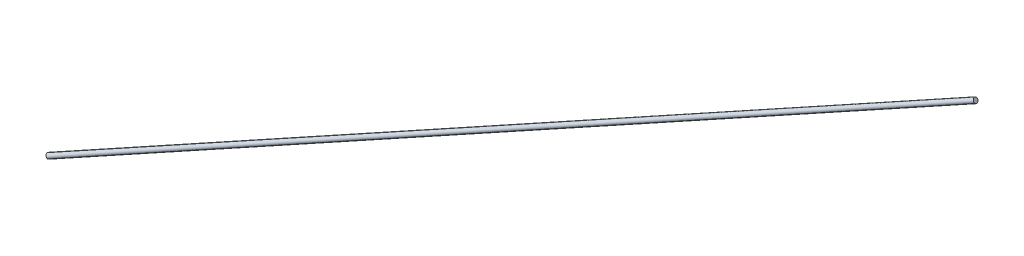
ISO-10303-21;
HEADER;
FILE_DESCRIPTION(('STEP AP214'),'2;1');
FILE_NAME('part.step','',(''),(''),'','','');
FILE_SCHEMA(('AUTOMOTIVE_DESIGN { 1 0 10303 214 1 1 1 1 }'));
ENDSEC;
DATA;
#1=APPLICATION_CONTEXT('core data for automotive mechanical design processes');
#2=APPLICATION_PROTOCOL_DEFINITION('international standard','automotive_design',2000,#1);
#3=PRODUCT_CONTEXT('',#1,'mechanical');
#4=PRODUCT('Part','Part','',(#3));
#5=PRODUCT_RELATED_PRODUCT_CATEGORY('part','',(#4));
#6=PRODUCT_DEFINITION_FORMATION('','',#4);
#7=PRODUCT_DEFINITION_CONTEXT('part definition',#1,'design');
#8=PRODUCT_DEFINITION('design','',#6,#7);
#9=PRODUCT_DEFINITION_SHAPE('','',#8);
#10=(LENGTH_UNIT() NAMED_UNIT(*) SI_UNIT(.MILLI.,.METRE.));
#11=(NAMED_UNIT(*) PLANE_ANGLE_UNIT() SI_UNIT($,.RADIAN.));
#12=(NAMED_UNIT(*) SI_UNIT($,.STERADIAN.) SOLID_ANGLE_UNIT());
#13=UNCERTAINTY_MEASURE_WITH_UNIT(LENGTH_MEASURE(1.E-05),#10,'distance_accuracy_value','');
#14=(GEOMETRIC_REPRESENTATION_CONTEXT(3) GLOBAL_UNCERTAINTY_ASSIGNED_CONTEXT((#13)) GLOBAL_UNIT_ASSIGNED_CONTEXT((#10,
#11,#12)) REPRESENTATION_CONTEXT('',''));
#15=CARTESIAN_POINT('',(0.,0.,0.));
#16=DIRECTION('',(0.,0.,1.));
#17=DIRECTION('',(1.,0.,0.));
#18=AXIS2_PLACEMENT_3D('',#15,#16,#17);
#19=CARTESIAN_POINT('',(1158.95080176922,2603.83710603682,1489.55455636954));
#20=DIRECTION('',(-0.892450020216378,-0.426162180196351,0.14804984831495));
#21=DIRECTION('',(0.43091086101726,-0.902394497909514,0.));
#22=AXIS2_PLACEMENT_3D('',#19,#20,#21);
#23=PLANE('',#22);
#24=CARTESIAN_POINT('',(1158.95080176922,2603.83710603682,1489.55455636954));
#25=DIRECTION('',(-0.892450020216378,-0.426162180196351,0.14804984831495));
#26=DIRECTION('',(0.43091086101726,-0.902394497909514,0.));
#27=AXIS2_PLACEMENT_3D('',#24,#25,#26);
#28=CIRCLE('',#27,5.07999999999994);
#29=CARTESIAN_POINT('',(1161.13982894319,2599.25294198744,1489.55455636954));
#30=VERTEX_POINT('',#29);
#31=EDGE_CURVE('E47',#30,#30,#28,.T.);
#32=ORIENTED_EDGE('',*,*,#31,.F.);
#33=EDGE_LOOP('',(#32));
#34=FACE_BOUND('',#33,.T.);
#35=ADVANCED_FACE('F40',(#34),#23,.F.);
#36=CARTESIAN_POINT('',(-479.349198230769,1821.51710603682,1761.3345563695));
#37=DIRECTION('',(-0.892450020216378,-0.426162180196351,0.14804984831495));
#38=DIRECTION('',(0.43091086101726,-0.902394497909514,0.));
#39=AXIS2_PLACEMENT_3D('',#36,#37,#38);
#40=PLANE('',#39);
#41=CARTESIAN_POINT('',(-479.349198230769,1821.51710603682,1761.3345563695));
#42=DIRECTION('',(-0.892450020216378,-0.426162180196351,0.14804984831495));
#43=DIRECTION('',(0.43091086101726,-0.902394497909514,0.));
#44=AXIS2_PLACEMENT_3D('',#41,#42,#43);
#45=CIRCLE('',#44,5.07999999999994);
#46=CARTESIAN_POINT('',(-477.160171056802,1816.93294198744,1761.3345563695));
#47=VERTEX_POINT('',#46);
#48=EDGE_CURVE('E12',#47,#47,#45,.T.);
#49=ORIENTED_EDGE('',*,*,#48,.T.);
#50=EDGE_LOOP('',(#49));
#51=FACE_BOUND('',#50,.T.);
#52=ADVANCED_FACE('F54',(#51),#40,.T.);
#53=CARTESIAN_POINT('',(1158.95080176922,2603.83710603682,1489.55455636954));
#54=DIRECTION('',(-0.892450020216378,-0.426162180196352,0.148049848314949));
#55=DIRECTION('',(0.43091086101726,-0.902394497909514,0.));
#56=AXIS2_PLACEMENT_3D('',#53,#54,#55);
#57=CYLINDRICAL_SURFACE('',#56,5.07999999999994);
#58=ORIENTED_EDGE('',*,*,#48,.F.);
#59=EDGE_LOOP('',(#58));
#60=FACE_BOUND('',#59,.T.);
#61=ORIENTED_EDGE('',*,*,#31,.T.);
#62=EDGE_LOOP('',(#61));
#63=FACE_BOUND('',#62,.T.);
#64=ADVANCED_FACE('F56',(#60,#63),#57,.T.);
#65=CLOSED_SHELL('',(#35,#52,#64));
#66=MANIFOLD_SOLID_BREP('B2',#65);
#67=ADVANCED_BREP_SHAPE_REPRESENTATION('',(#18,#66),#14);
#68=SHAPE_DEFINITION_REPRESENTATION(#9,#67);
ENDSEC;
END-ISO-10303-21;
